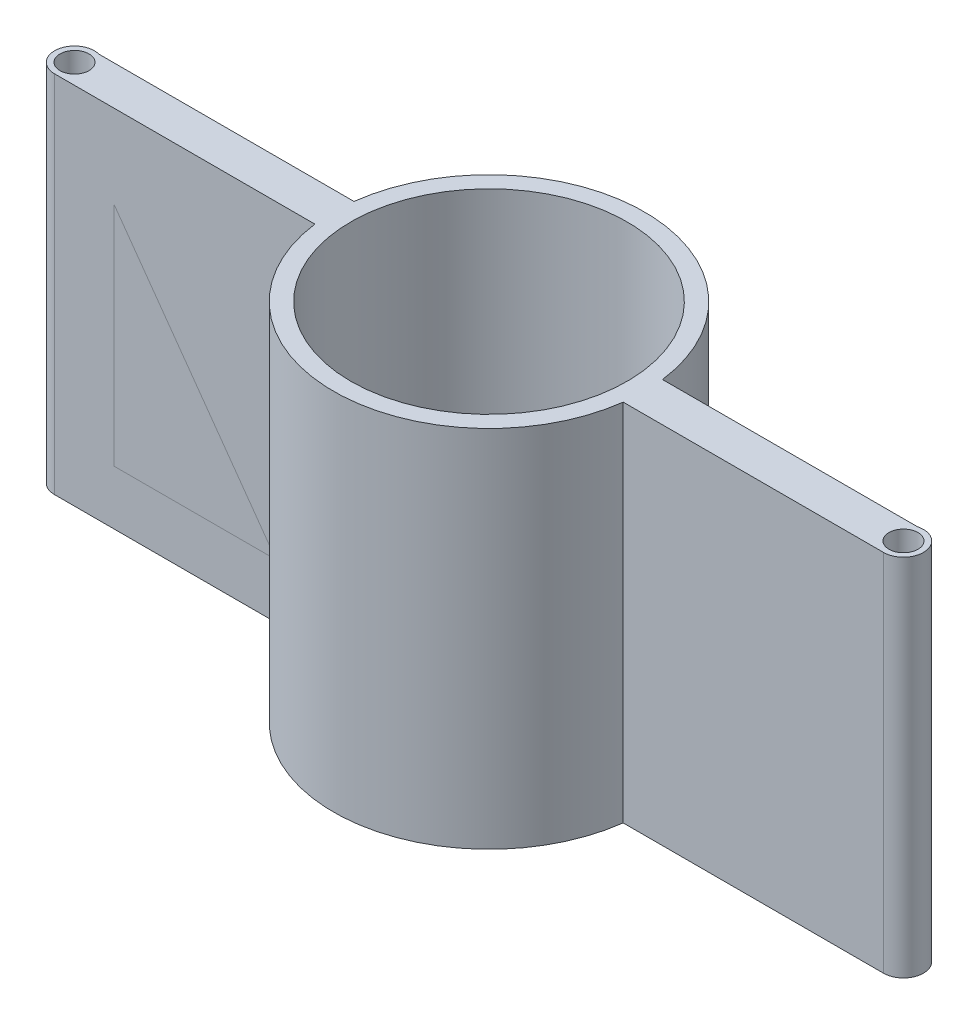
ISO-10303-21;
HEADER;
FILE_DESCRIPTION(('STEP AP214'),'2;1');
FILE_NAME('part.step','',(''),(''),'','','');
FILE_SCHEMA(('AUTOMOTIVE_DESIGN { 1 0 10303 214 1 1 1 1 }'));
ENDSEC;
DATA;
#1=APPLICATION_CONTEXT('core data for automotive mechanical design processes');
#2=APPLICATION_PROTOCOL_DEFINITION('international standard','automotive_design',2000,#1);
#3=PRODUCT_CONTEXT('',#1,'mechanical');
#4=PRODUCT('Part','Part','',(#3));
#5=PRODUCT_RELATED_PRODUCT_CATEGORY('part','',(#4));
#6=PRODUCT_DEFINITION_FORMATION('','',#4);
#7=PRODUCT_DEFINITION_CONTEXT('part definition',#1,'design');
#8=PRODUCT_DEFINITION('design','',#6,#7);
#9=PRODUCT_DEFINITION_SHAPE('','',#8);
#10=(LENGTH_UNIT() NAMED_UNIT(*) SI_UNIT(.MILLI.,.METRE.));
#11=(NAMED_UNIT(*) PLANE_ANGLE_UNIT() SI_UNIT($,.RADIAN.));
#12=(NAMED_UNIT(*) SI_UNIT($,.STERADIAN.) SOLID_ANGLE_UNIT());
#13=UNCERTAINTY_MEASURE_WITH_UNIT(LENGTH_MEASURE(1.E-05),#10,'distance_accuracy_value','');
#14=(GEOMETRIC_REPRESENTATION_CONTEXT(3) GLOBAL_UNCERTAINTY_ASSIGNED_CONTEXT((#13)) GLOBAL_UNIT_ASSIGNED_CONTEXT((#10,
#11,#12)) REPRESENTATION_CONTEXT('',''));
#15=CARTESIAN_POINT('',(0.,0.,0.));
#16=DIRECTION('',(0.,0.,1.));
#17=DIRECTION('',(1.,0.,0.));
#18=AXIS2_PLACEMENT_3D('',#15,#16,#17);
#19=CARTESIAN_POINT('',(0.,67.,3.66914743507707));
#20=DIRECTION('',(0.,0.,1.));
#21=DIRECTION('',(1.,0.,0.));
#22=AXIS2_PLACEMENT_3D('',#19,#20,#21);
#23=PLANE('',#22);
#24=DIRECTION('',(0.,1.,0.));
#25=VECTOR('',#24,1.);
#26=CARTESIAN_POINT('',(28.3548949710382,57.,3.66914743507707));
#27=LINE('',#26,#25);
#28=CARTESIAN_POINT('',(28.3548949710382,10.,3.66914743507707));
#29=VERTEX_POINT('',#28);
#30=CARTESIAN_POINT('',(28.3548949710382,57.,3.66914743507707));
#31=VERTEX_POINT('',#30);
#32=EDGE_CURVE('E62',#29,#31,#27,.T.);
#33=ORIENTED_EDGE('',*,*,#32,.F.);
#34=DIRECTION('',(-1.,0.,0.));
#35=VECTOR('',#34,1.);
#36=CARTESIAN_POINT('',(28.3548949710382,10.,3.66914743507707));
#37=LINE('',#36,#35);
#38=CARTESIAN_POINT('',(65.2345536167447,9.99999999999999,3.66914743507707));
#39=VERTEX_POINT('',#38);
#40=EDGE_CURVE('E85',#39,#29,#37,.T.);
#41=ORIENTED_EDGE('',*,*,#40,.F.);
#42=DIRECTION('',(0.,-1.,0.));
#43=VECTOR('',#42,1.);
#44=CARTESIAN_POINT('',(65.2345536167447,57.,3.66914743507707));
#45=LINE('',#44,#43);
#46=CARTESIAN_POINT('',(65.2345536167447,57.,3.66914743507707));
#47=VERTEX_POINT('',#46);
#48=EDGE_CURVE('E90',#47,#39,#45,.T.);
#49=ORIENTED_EDGE('',*,*,#48,.F.);
#50=DIRECTION('',(1.,0.,0.));
#51=VECTOR('',#50,1.);
#52=CARTESIAN_POINT('',(28.3548949710382,57.,3.66914743507707));
#53=LINE('',#52,#51);
#54=EDGE_CURVE('E105',#31,#47,#53,.T.);
#55=ORIENTED_EDGE('',*,*,#54,.F.);
#56=EDGE_LOOP('',(#33,#41,#49,#55));
#57=FACE_BOUND('',#56,.T.);
#58=ADVANCED_FACE('F54',(#57),#23,.T.);
#59=CARTESIAN_POINT('',(0.,0.,-3.53985256492292));
#60=DIRECTION('',(0.,0.,1.));
#61=DIRECTION('',(1.,0.,0.));
#62=AXIS2_PLACEMENT_3D('',#59,#60,#61);
#63=PLANE('',#62);
#64=DIRECTION('',(0.,1.,0.));
#65=VECTOR('',#64,1.);
#66=CARTESIAN_POINT('',(28.3548949710382,57.,-3.53985256492291));
#67=LINE('',#66,#65);
#68=CARTESIAN_POINT('',(28.3548949710382,10.,-3.53985256492291));
#69=VERTEX_POINT('',#68);
#70=CARTESIAN_POINT('',(28.3548949710382,57.,-3.53985256492291));
#71=VERTEX_POINT('',#70);
#72=EDGE_CURVE('E114',#69,#71,#67,.T.);
#73=ORIENTED_EDGE('',*,*,#72,.T.);
#74=DIRECTION('',(1.,0.,0.));
#75=VECTOR('',#74,1.);
#76=CARTESIAN_POINT('',(28.3548949710382,57.,-3.53985256492291));
#77=LINE('',#76,#75);
#78=CARTESIAN_POINT('',(65.2345536167447,57.,-3.53985256492291));
#79=VERTEX_POINT('',#78);
#80=EDGE_CURVE('E103',#71,#79,#77,.T.);
#81=ORIENTED_EDGE('',*,*,#80,.T.);
#82=DIRECTION('',(0.,-1.,0.));
#83=VECTOR('',#82,1.);
#84=CARTESIAN_POINT('',(65.2345536167447,57.,-3.53985256492291));
#85=LINE('',#84,#83);
#86=CARTESIAN_POINT('',(65.2345536167447,9.99999999999999,-3.53985256492291));
#87=VERTEX_POINT('',#86);
#88=EDGE_CURVE('E106',#79,#87,#85,.T.);
#89=ORIENTED_EDGE('',*,*,#88,.T.);
#90=DIRECTION('',(-1.,0.,0.));
#91=VECTOR('',#90,1.);
#92=CARTESIAN_POINT('',(28.3548949710382,10.,-3.53985256492291));
#93=LINE('',#92,#91);
#94=EDGE_CURVE('E111',#87,#69,#93,.T.);
#95=ORIENTED_EDGE('',*,*,#94,.T.);
#96=EDGE_LOOP('',(#73,#81,#89,#95));
#97=FACE_BOUND('',#96,.T.);
#98=ADVANCED_FACE('F113',(#97),#63,.F.);
#99=CARTESIAN_POINT('',(28.3548949710382,57.,63.4111696792548));
#100=DIRECTION('',(0.,1.,0.));
#101=DIRECTION('',(-1.,0.,0.));
#102=AXIS2_PLACEMENT_3D('',#99,#100,#101);
#103=PLANE('',#102);
#104=DIRECTION('',(0.,0.,-1.));
#105=VECTOR('',#104,1.);
#106=CARTESIAN_POINT('',(28.3548949710382,57.,63.4111696792548));
#107=LINE('',#106,#105);
#108=EDGE_CURVE('E12',#31,#71,#107,.T.);
#109=ORIENTED_EDGE('',*,*,#108,.F.);
#110=ORIENTED_EDGE('',*,*,#54,.T.);
#111=DIRECTION('',(0.,0.,-1.));
#112=VECTOR('',#111,1.);
#113=CARTESIAN_POINT('',(65.2345536167447,57.,63.4111696792548));
#114=LINE('',#113,#112);
#115=EDGE_CURVE('E100',#47,#79,#114,.T.);
#116=ORIENTED_EDGE('',*,*,#115,.T.);
#117=ORIENTED_EDGE('',*,*,#80,.F.);
#118=EDGE_LOOP('',(#109,#110,#116,#117));
#119=FACE_BOUND('',#118,.T.);
#120=ADVANCED_FACE('F101',(#119),#103,.T.);
#121=CARTESIAN_POINT('',(65.2345536167447,57.,63.4111696792548));
#122=DIRECTION('',(1.,0.,0.));
#123=DIRECTION('',(0.,1.,0.));
#124=AXIS2_PLACEMENT_3D('',#121,#122,#123);
#125=PLANE('',#124);
#126=ORIENTED_EDGE('',*,*,#115,.F.);
#127=ORIENTED_EDGE('',*,*,#48,.T.);
#128=DIRECTION('',(0.,0.,-1.));
#129=VECTOR('',#128,1.);
#130=CARTESIAN_POINT('',(65.2345536167446,9.99999999999999,63.4111696792548));
#131=LINE('',#130,#129);
#132=EDGE_CURVE('E95',#39,#87,#131,.T.);
#133=ORIENTED_EDGE('',*,*,#132,.T.);
#134=ORIENTED_EDGE('',*,*,#88,.F.);
#135=EDGE_LOOP('',(#126,#127,#133,#134));
#136=FACE_BOUND('',#135,.T.);
#137=ADVANCED_FACE('F107',(#136),#125,.T.);
#138=CARTESIAN_POINT('',(28.3548949710382,10.,63.4111696792548));
#139=DIRECTION('',(0.,-1.,0.));
#140=DIRECTION('',(1.,0.,0.));
#141=AXIS2_PLACEMENT_3D('',#138,#139,#140);
#142=PLANE('',#141);
#143=ORIENTED_EDGE('',*,*,#132,.F.);
#144=ORIENTED_EDGE('',*,*,#40,.T.);
#145=DIRECTION('',(0.,0.,-1.));
#146=VECTOR('',#145,1.);
#147=CARTESIAN_POINT('',(28.3548949710382,10.,63.4111696792548));
#148=LINE('',#147,#146);
#149=EDGE_CURVE('E121',#29,#69,#148,.T.);
#150=ORIENTED_EDGE('',*,*,#149,.T.);
#151=ORIENTED_EDGE('',*,*,#94,.F.);
#152=EDGE_LOOP('',(#143,#144,#150,#151));
#153=FACE_BOUND('',#152,.T.);
#154=ADVANCED_FACE('F127',(#153),#142,.T.);
#155=CARTESIAN_POINT('',(28.3548949710382,57.,63.4111696792548));
#156=DIRECTION('',(-1.,0.,0.));
#157=DIRECTION('',(0.,-1.,0.));
#158=AXIS2_PLACEMENT_3D('',#155,#156,#157);
#159=PLANE('',#158);
#160=ORIENTED_EDGE('',*,*,#149,.F.);
#161=ORIENTED_EDGE('',*,*,#32,.T.);
#162=ORIENTED_EDGE('',*,*,#108,.T.);
#163=ORIENTED_EDGE('',*,*,#72,.F.);
#164=EDGE_LOOP('',(#160,#161,#162,#163));
#165=FACE_BOUND('',#164,.T.);
#166=ADVANCED_FACE('F128',(#165),#159,.T.);
#167=CLOSED_SHELL('',(#58,#98,#120,#137,#154,#166));
#168=MANIFOLD_SOLID_BREP('B2',#167);
#169=CARTESIAN_POINT('',(-28.3548949710382,57.,63.4111696792548));
#170=DIRECTION('',(1.,0.,0.));
#171=DIRECTION('',(0.,1.,0.));
#172=AXIS2_PLACEMENT_3D('',#169,#170,#171);
#173=PLANE('',#172);
#174=DIRECTION('',(0.,1.,0.));
#175=VECTOR('',#174,1.);
#176=CARTESIAN_POINT('',(-28.3548949710382,57.,3.66914743507706));
#177=LINE('',#176,#175);
#178=CARTESIAN_POINT('',(-28.3548949710382,10.,3.66914743507706));
#179=VERTEX_POINT('',#178);
#180=CARTESIAN_POINT('',(-28.3548949710382,57.,3.66914743507706));
#181=VERTEX_POINT('',#180);
#182=EDGE_CURVE('E195',#179,#181,#177,.T.);
#183=ORIENTED_EDGE('',*,*,#182,.F.);
#184=DIRECTION('',(0.,0.,-1.));
#185=VECTOR('',#184,1.);
#186=CARTESIAN_POINT('',(-28.3548949710382,10.,63.4111696792548));
#187=LINE('',#186,#185);
#188=CARTESIAN_POINT('',(-28.3548949710382,10.,-3.53985256492294));
#189=VERTEX_POINT('',#188);
#190=EDGE_CURVE('E223',#179,#189,#187,.T.);
#191=ORIENTED_EDGE('',*,*,#190,.T.);
#192=DIRECTION('',(0.,-1.,0.));
#193=VECTOR('',#192,1.);
#194=CARTESIAN_POINT('',(-28.3548949710382,57.,-3.53985256492294));
#195=LINE('',#194,#193);
#196=CARTESIAN_POINT('',(-28.3548949710382,57.,-3.53985256492294));
#197=VERTEX_POINT('',#196);
#198=EDGE_CURVE('E227',#197,#189,#195,.T.);
#199=ORIENTED_EDGE('',*,*,#198,.F.);
#200=DIRECTION('',(0.,0.,-1.));
#201=VECTOR('',#200,1.);
#202=CARTESIAN_POINT('',(-28.3548949710382,57.,63.4111696792548));
#203=LINE('',#202,#201);
#204=EDGE_CURVE('E250',#181,#197,#203,.T.);
#205=ORIENTED_EDGE('',*,*,#204,.F.);
#206=EDGE_LOOP('',(#183,#191,#199,#205));
#207=FACE_BOUND('',#206,.T.);
#208=ADVANCED_FACE('F187',(#207),#173,.T.);
#209=CARTESIAN_POINT('',(-28.3548949710382,57.,63.4111696792548));
#210=DIRECTION('',(0.,1.,0.));
#211=DIRECTION('',(0.,0.,1.));
#212=AXIS2_PLACEMENT_3D('',#209,#210,#211);
#213=PLANE('',#212);
#214=DIRECTION('',(-1.,0.,0.));
#215=VECTOR('',#214,1.);
#216=CARTESIAN_POINT('',(-28.3548949710382,57.,3.66914743507706));
#217=LINE('',#216,#215);
#218=CARTESIAN_POINT('',(-65.2345536167447,57.,3.66914743507706));
#219=VERTEX_POINT('',#218);
#220=EDGE_CURVE('E201',#181,#219,#217,.T.);
#221=ORIENTED_EDGE('',*,*,#220,.F.);
#222=ORIENTED_EDGE('',*,*,#204,.T.);
#223=DIRECTION('',(1.,0.,0.));
#224=VECTOR('',#223,1.);
#225=CARTESIAN_POINT('',(-28.3548949710382,57.,-3.53985256492294));
#226=LINE('',#225,#224);
#227=CARTESIAN_POINT('',(-65.2345536167447,57.,-3.53985256492294));
#228=VERTEX_POINT('',#227);
#229=EDGE_CURVE('E232',#228,#197,#226,.T.);
#230=ORIENTED_EDGE('',*,*,#229,.F.);
#231=DIRECTION('',(0.,0.,-1.));
#232=VECTOR('',#231,1.);
#233=CARTESIAN_POINT('',(-65.2345536167447,57.,63.4111696792548));
#234=LINE('',#233,#232);
#235=EDGE_CURVE('E253',#219,#228,#234,.T.);
#236=ORIENTED_EDGE('',*,*,#235,.F.);
#237=EDGE_LOOP('',(#221,#222,#230,#236));
#238=FACE_BOUND('',#237,.T.);
#239=ADVANCED_FACE('F259',(#238),#213,.T.);
#240=CARTESIAN_POINT('',(-65.2345536167447,57.,63.4111696792548));
#241=DIRECTION('',(-1.,0.,0.));
#242=DIRECTION('',(0.,-1.,0.));
#243=AXIS2_PLACEMENT_3D('',#240,#241,#242);
#244=PLANE('',#243);
#245=DIRECTION('',(0.,-1.,0.));
#246=VECTOR('',#245,1.);
#247=CARTESIAN_POINT('',(-65.2345536167447,57.,3.66914743507706));
#248=LINE('',#247,#246);
#249=CARTESIAN_POINT('',(-65.2345536167447,10.,3.66914743507706));
#250=VERTEX_POINT('',#249);
#251=EDGE_CURVE('E252',#219,#250,#248,.T.);
#252=ORIENTED_EDGE('',*,*,#251,.F.);
#253=ORIENTED_EDGE('',*,*,#235,.T.);
#254=DIRECTION('',(0.,1.,0.));
#255=VECTOR('',#254,1.);
#256=CARTESIAN_POINT('',(-65.2345536167447,57.,-3.53985256492294));
#257=LINE('',#256,#255);
#258=CARTESIAN_POINT('',(-65.2345536167447,10.,-3.53985256492294));
#259=VERTEX_POINT('',#258);
#260=EDGE_CURVE('E240',#259,#228,#257,.T.);
#261=ORIENTED_EDGE('',*,*,#260,.F.);
#262=DIRECTION('',(0.,0.,-1.));
#263=VECTOR('',#262,1.);
#264=CARTESIAN_POINT('',(-65.2345536167447,10.,63.4111696792548));
#265=LINE('',#264,#263);
#266=EDGE_CURVE('E231',#250,#259,#265,.T.);
#267=ORIENTED_EDGE('',*,*,#266,.F.);
#268=EDGE_LOOP('',(#252,#253,#261,#267));
#269=FACE_BOUND('',#268,.T.);
#270=ADVANCED_FACE('F257',(#269),#244,.T.);
#271=CARTESIAN_POINT('',(-28.3548949710382,10.,63.4111696792548));
#272=DIRECTION('',(0.,-1.,0.));
#273=DIRECTION('',(1.,0.,0.));
#274=AXIS2_PLACEMENT_3D('',#271,#272,#273);
#275=PLANE('',#274);
#276=DIRECTION('',(1.,0.,0.));
#277=VECTOR('',#276,1.);
#278=CARTESIAN_POINT('',(-28.3548949710382,10.,3.66914743507706));
#279=LINE('',#278,#277);
#280=EDGE_CURVE('E52',#250,#179,#279,.T.);
#281=ORIENTED_EDGE('',*,*,#280,.F.);
#282=ORIENTED_EDGE('',*,*,#266,.T.);
#283=DIRECTION('',(-1.,0.,0.));
#284=VECTOR('',#283,1.);
#285=CARTESIAN_POINT('',(-28.3548949710382,10.,-3.53985256492294));
#286=LINE('',#285,#284);
#287=EDGE_CURVE('E234',#189,#259,#286,.T.);
#288=ORIENTED_EDGE('',*,*,#287,.F.);
#289=ORIENTED_EDGE('',*,*,#190,.F.);
#290=EDGE_LOOP('',(#281,#282,#288,#289));
#291=FACE_BOUND('',#290,.T.);
#292=ADVANCED_FACE('F235',(#291),#275,.T.);
#293=CARTESIAN_POINT('',(0.,0.,-3.53985256492294));
#294=DIRECTION('',(0.,0.,-1.));
#295=DIRECTION('',(-1.,0.,0.));
#296=AXIS2_PLACEMENT_3D('',#293,#294,#295);
#297=PLANE('',#296);
#298=ORIENTED_EDGE('',*,*,#198,.T.);
#299=ORIENTED_EDGE('',*,*,#287,.T.);
#300=ORIENTED_EDGE('',*,*,#260,.T.);
#301=ORIENTED_EDGE('',*,*,#229,.T.);
#302=EDGE_LOOP('',(#298,#299,#300,#301));
#303=FACE_BOUND('',#302,.T.);
#304=ADVANCED_FACE('F242',(#303),#297,.T.);
#305=CARTESIAN_POINT('',(0.,67.,3.66914743507705));
#306=DIRECTION('',(0.,0.,-1.));
#307=DIRECTION('',(-1.,0.,0.));
#308=AXIS2_PLACEMENT_3D('',#305,#306,#307);
#309=PLANE('',#308);
#310=ORIENTED_EDGE('',*,*,#182,.T.);
#311=ORIENTED_EDGE('',*,*,#220,.T.);
#312=ORIENTED_EDGE('',*,*,#251,.T.);
#313=ORIENTED_EDGE('',*,*,#280,.T.);
#314=EDGE_LOOP('',(#310,#311,#312,#313));
#315=FACE_BOUND('',#314,.T.);
#316=ADVANCED_FACE('F261',(#315),#309,.F.);
#317=CLOSED_SHELL('',(#208,#239,#270,#292,#304,#316));
#318=MANIFOLD_SOLID_BREP('B6',#317);
#319=CARTESIAN_POINT('',(0.,67.,-3.53985256492292));
#320=DIRECTION('',(0.,0.,-1.));
#321=DIRECTION('',(-1.,0.,0.));
#322=AXIS2_PLACEMENT_3D('',#319,#320,#321);
#323=PLANE('',#322);
#324=DIRECTION('',(1.,0.,0.));
#325=VECTOR('',#324,1.);
#326=CARTESIAN_POINT('',(0.,0.,-3.53985256492292));
#327=LINE('',#326,#325);
#328=CARTESIAN_POINT('',(28.3548949710382,0.,-3.53985256492291));
#329=VERTEX_POINT('',#328);
#330=CARTESIAN_POINT('',(75.2345536167447,0.,-3.53985256492291));
#331=VERTEX_POINT('',#330);
#332=EDGE_CURVE('E415',#329,#331,#327,.T.);
#333=ORIENTED_EDGE('',*,*,#332,.F.);
#334=DIRECTION('',(0.,-1.,0.));
#335=VECTOR('',#334,1.);
#336=CARTESIAN_POINT('',(28.3548949710382,67.,-3.53985256492291));
#337=LINE('',#336,#335);
#338=CARTESIAN_POINT('',(28.3548949710382,67.,-3.53985256492291));
#339=VERTEX_POINT('',#338);
#340=EDGE_CURVE('E185',#339,#329,#337,.T.);
#341=ORIENTED_EDGE('',*,*,#340,.F.);
#342=DIRECTION('',(1.,0.,0.));
#343=VECTOR('',#342,1.);
#344=CARTESIAN_POINT('',(0.,67.,-3.53985256492292));
#345=LINE('',#344,#343);
#346=CARTESIAN_POINT('',(75.2345536167447,67.,-3.53985256492291));
#347=VERTEX_POINT('',#346);
#348=EDGE_CURVE('E440',#339,#347,#345,.T.);
#349=ORIENTED_EDGE('',*,*,#348,.T.);
#350=DIRECTION('',(0.,-1.,0.));
#351=VECTOR('',#350,1.);
#352=CARTESIAN_POINT('',(75.2345536167447,67.,-3.53985256492291));
#353=LINE('',#352,#351);
#354=EDGE_CURVE('E327',#347,#331,#353,.T.);
#355=ORIENTED_EDGE('',*,*,#354,.T.);
#356=EDGE_LOOP('',(#333,#341,#349,#355));
#357=FACE_BOUND('',#356,.T.);
#358=ADVANCED_FACE('F311',(#357),#323,.T.);
#359=CARTESIAN_POINT('',(0.,67.,0.));
#360=DIRECTION('',(0.,-1.,0.));
#361=DIRECTION('',(0.,0.,-1.));
#362=AXIS2_PLACEMENT_3D('',#359,#360,#361);
#363=CYLINDRICAL_SURFACE('',#362,28.575);
#364=CARTESIAN_POINT('',(0.,0.,0.));
#365=DIRECTION('',(0.,1.,0.));
#366=DIRECTION('',(0.,0.,1.));
#367=AXIS2_PLACEMENT_3D('',#364,#365,#366);
#368=CIRCLE('',#367,28.575);
#369=CARTESIAN_POINT('',(-28.3548949710382,0.,-3.53985256492294));
#370=VERTEX_POINT('',#369);
#371=EDGE_CURVE('E417',#329,#370,#368,.T.);
#372=ORIENTED_EDGE('',*,*,#371,.T.);
#373=DIRECTION('',(0.,-1.,0.));
#374=VECTOR('',#373,1.);
#375=CARTESIAN_POINT('',(-28.3548949710382,67.,-3.53985256492294));
#376=LINE('',#375,#374);
#377=CARTESIAN_POINT('',(-28.3548949710382,67.,-3.53985256492294));
#378=VERTEX_POINT('',#377);
#379=EDGE_CURVE('E319',#378,#370,#376,.T.);
#380=ORIENTED_EDGE('',*,*,#379,.F.);
#381=CARTESIAN_POINT('',(0.,67.,0.));
#382=DIRECTION('',(0.,1.,0.));
#383=DIRECTION('',(0.,0.,1.));
#384=AXIS2_PLACEMENT_3D('',#381,#382,#383);
#385=CIRCLE('',#384,28.575);
#386=EDGE_CURVE('E474',#339,#378,#385,.T.);
#387=ORIENTED_EDGE('',*,*,#386,.F.);
#388=ORIENTED_EDGE('',*,*,#340,.T.);
#389=EDGE_LOOP('',(#372,#380,#387,#388));
#390=FACE_BOUND('',#389,.T.);
#391=ADVANCED_FACE('F492',(#390),#363,.T.);
#392=CARTESIAN_POINT('',(0.,67.,-3.53985256492294));
#393=DIRECTION('',(0.,0.,1.));
#394=DIRECTION('',(1.,0.,0.));
#395=AXIS2_PLACEMENT_3D('',#392,#393,#394);
#396=PLANE('',#395);
#397=DIRECTION('',(-1.,0.,0.));
#398=VECTOR('',#397,1.);
#399=CARTESIAN_POINT('',(0.,0.,-3.53985256492294));
#400=LINE('',#399,#398);
#401=CARTESIAN_POINT('',(-75.2345536167447,0.,-3.53985256492294));
#402=VERTEX_POINT('',#401);
#403=EDGE_CURVE('E419',#370,#402,#400,.T.);
#404=ORIENTED_EDGE('',*,*,#403,.T.);
#405=DIRECTION('',(0.,-1.,0.));
#406=VECTOR('',#405,1.);
#407=CARTESIAN_POINT('',(-75.2345536167447,67.,-3.53985256492294));
#408=LINE('',#407,#406);
#409=CARTESIAN_POINT('',(-75.2345536167447,67.,-3.53985256492294));
#410=VERTEX_POINT('',#409);
#411=EDGE_CURVE('E447',#410,#402,#408,.T.);
#412=ORIENTED_EDGE('',*,*,#411,.F.);
#413=DIRECTION('',(-1.,0.,0.));
#414=VECTOR('',#413,1.);
#415=CARTESIAN_POINT('',(0.,67.,-3.53985256492294));
#416=LINE('',#415,#414);
#417=EDGE_CURVE('E456',#378,#410,#416,.T.);
#418=ORIENTED_EDGE('',*,*,#417,.F.);
#419=ORIENTED_EDGE('',*,*,#379,.T.);
#420=EDGE_LOOP('',(#404,#412,#418,#419));
#421=FACE_BOUND('',#420,.T.);
#422=ADVANCED_FACE('F454',(#421),#396,.F.);
#423=CARTESIAN_POINT('',(-76.2,67.,0.));
#424=DIRECTION('',(0.,-1.,0.));
#425=DIRECTION('',(0.,0.,-1.));
#426=AXIS2_PLACEMENT_3D('',#423,#424,#425);
#427=CYLINDRICAL_SURFACE('',#426,3.66914743507703);
#428=CARTESIAN_POINT('',(-76.2,0.,0.));
#429=DIRECTION('',(0.,1.,0.));
#430=DIRECTION('',(0.,0.,1.));
#431=AXIS2_PLACEMENT_3D('',#428,#429,#430);
#432=CIRCLE('',#431,3.66914743507703);
#433=CARTESIAN_POINT('',(-76.2,0.,3.66914743507705));
#434=VERTEX_POINT('',#433);
#435=EDGE_CURVE('E421',#402,#434,#432,.T.);
#436=ORIENTED_EDGE('',*,*,#435,.T.);
#437=DIRECTION('',(0.,-1.,0.));
#438=VECTOR('',#437,1.);
#439=CARTESIAN_POINT('',(-76.2,67.,3.66914743507705));
#440=LINE('',#439,#438);
#441=CARTESIAN_POINT('',(-76.2,67.,3.66914743507705));
#442=VERTEX_POINT('',#441);
#443=EDGE_CURVE('E444',#442,#434,#440,.T.);
#444=ORIENTED_EDGE('',*,*,#443,.F.);
#445=CARTESIAN_POINT('',(-76.2,67.,0.));
#446=DIRECTION('',(0.,1.,0.));
#447=DIRECTION('',(0.,0.,1.));
#448=AXIS2_PLACEMENT_3D('',#445,#446,#447);
#449=CIRCLE('',#448,3.66914743507703);
#450=EDGE_CURVE('E470',#410,#442,#449,.T.);
#451=ORIENTED_EDGE('',*,*,#450,.F.);
#452=ORIENTED_EDGE('',*,*,#411,.T.);
#453=EDGE_LOOP('',(#436,#444,#451,#452));
#454=FACE_BOUND('',#453,.T.);
#455=ADVANCED_FACE('F466',(#454),#427,.T.);
#456=CARTESIAN_POINT('',(0.,67.,3.66914743507705));
#457=DIRECTION('',(0.,0.,-1.));
#458=DIRECTION('',(-1.,0.,0.));
#459=AXIS2_PLACEMENT_3D('',#456,#457,#458);
#460=PLANE('',#459);
#461=DIRECTION('',(1.,0.,0.));
#462=VECTOR('',#461,1.);
#463=CARTESIAN_POINT('',(0.,0.,3.66914743507705));
#464=LINE('',#463,#462);
#465=CARTESIAN_POINT('',(-28.3384541233227,0.,3.66914743507705));
#466=VERTEX_POINT('',#465);
#467=EDGE_CURVE('E423',#434,#466,#464,.T.);
#468=ORIENTED_EDGE('',*,*,#467,.T.);
#469=DIRECTION('',(0.,-1.,0.));
#470=VECTOR('',#469,1.);
#471=CARTESIAN_POINT('',(-28.3384541233227,67.,3.66914743507705));
#472=LINE('',#471,#470);
#473=CARTESIAN_POINT('',(-28.3384541233227,67.,3.66914743507705));
#474=VERTEX_POINT('',#473);
#475=EDGE_CURVE('E398',#474,#466,#472,.T.);
#476=ORIENTED_EDGE('',*,*,#475,.F.);
#477=DIRECTION('',(1.,0.,0.));
#478=VECTOR('',#477,1.);
#479=CARTESIAN_POINT('',(0.,67.,3.66914743507705));
#480=LINE('',#479,#478);
#481=EDGE_CURVE('E386',#442,#474,#480,.T.);
#482=ORIENTED_EDGE('',*,*,#481,.F.);
#483=ORIENTED_EDGE('',*,*,#443,.T.);
#484=EDGE_LOOP('',(#468,#476,#482,#483));
#485=FACE_BOUND('',#484,.T.);
#486=ADVANCED_FACE('F469',(#485),#460,.F.);
#487=CARTESIAN_POINT('',(0.,67.,0.));
#488=DIRECTION('',(0.,-1.,0.));
#489=DIRECTION('',(0.,0.,-1.));
#490=AXIS2_PLACEMENT_3D('',#487,#488,#489);
#491=CYLINDRICAL_SURFACE('',#490,28.575);
#492=CARTESIAN_POINT('',(0.,0.,0.));
#493=DIRECTION('',(0.,1.,0.));
#494=DIRECTION('',(0.,0.,1.));
#495=AXIS2_PLACEMENT_3D('',#492,#493,#494);
#496=CIRCLE('',#495,28.575);
#497=CARTESIAN_POINT('',(28.3384541233227,0.,3.66914743507707));
#498=VERTEX_POINT('',#497);
#499=EDGE_CURVE('E395',#466,#498,#496,.T.);
#500=ORIENTED_EDGE('',*,*,#499,.T.);
#501=DIRECTION('',(0.,-1.,0.));
#502=VECTOR('',#501,1.);
#503=CARTESIAN_POINT('',(28.3384541233227,67.,3.66914743507707));
#504=LINE('',#503,#502);
#505=CARTESIAN_POINT('',(28.3384541233227,67.,3.66914743507707));
#506=VERTEX_POINT('',#505);
#507=EDGE_CURVE('E392',#506,#498,#504,.T.);
#508=ORIENTED_EDGE('',*,*,#507,.F.);
#509=CARTESIAN_POINT('',(0.,67.,0.));
#510=DIRECTION('',(0.,1.,0.));
#511=DIRECTION('',(0.,0.,1.));
#512=AXIS2_PLACEMENT_3D('',#509,#510,#511);
#513=CIRCLE('',#512,28.575);
#514=EDGE_CURVE('E377',#474,#506,#513,.T.);
#515=ORIENTED_EDGE('',*,*,#514,.F.);
#516=ORIENTED_EDGE('',*,*,#475,.T.);
#517=EDGE_LOOP('',(#500,#508,#515,#516));
#518=FACE_BOUND('',#517,.T.);
#519=ADVANCED_FACE('F393',(#518),#491,.T.);
#520=CARTESIAN_POINT('',(0.,67.,3.66914743507707));
#521=DIRECTION('',(0.,0.,1.));
#522=DIRECTION('',(1.,0.,0.));
#523=AXIS2_PLACEMENT_3D('',#520,#521,#522);
#524=PLANE('',#523);
#525=DIRECTION('',(-1.,0.,0.));
#526=VECTOR('',#525,1.);
#527=CARTESIAN_POINT('',(0.,0.,3.66914743507707));
#528=LINE('',#527,#526);
#529=CARTESIAN_POINT('',(76.2,0.,3.66914743507706));
#530=VERTEX_POINT('',#529);
#531=EDGE_CURVE('E426',#530,#498,#528,.T.);
#532=ORIENTED_EDGE('',*,*,#531,.F.);
#533=DIRECTION('',(0.,-1.,0.));
#534=VECTOR('',#533,1.);
#535=CARTESIAN_POINT('',(76.2,67.,3.66914743507706));
#536=LINE('',#535,#534);
#537=CARTESIAN_POINT('',(76.2,67.,3.66914743507706));
#538=VERTEX_POINT('',#537);
#539=EDGE_CURVE('E352',#538,#530,#536,.T.);
#540=ORIENTED_EDGE('',*,*,#539,.F.);
#541=DIRECTION('',(-1.,0.,0.));
#542=VECTOR('',#541,1.);
#543=CARTESIAN_POINT('',(0.,67.,3.66914743507707));
#544=LINE('',#543,#542);
#545=EDGE_CURVE('E384',#538,#506,#544,.T.);
#546=ORIENTED_EDGE('',*,*,#545,.T.);
#547=ORIENTED_EDGE('',*,*,#507,.T.);
#548=EDGE_LOOP('',(#532,#540,#546,#547));
#549=FACE_BOUND('',#548,.T.);
#550=ADVANCED_FACE('F400',(#549),#524,.T.);
#551=CARTESIAN_POINT('',(0.,67.,0.));
#552=DIRECTION('',(0.,-1.,0.));
#553=DIRECTION('',(0.,0.,-1.));
#554=AXIS2_PLACEMENT_3D('',#551,#552,#553);
#555=CYLINDRICAL_SURFACE('',#554,25.4);
#556=CARTESIAN_POINT('',(0.,67.,0.));
#557=DIRECTION('',(0.,1.,0.));
#558=DIRECTION('',(0.,0.,1.));
#559=AXIS2_PLACEMENT_3D('',#556,#557,#558);
#560=CIRCLE('',#559,25.4);
#561=CARTESIAN_POINT('',(0.,67.,25.4));
#562=VERTEX_POINT('',#561);
#563=EDGE_CURVE('E409',#562,#562,#560,.T.);
#564=ORIENTED_EDGE('',*,*,#563,.T.);
#565=EDGE_LOOP('',(#564));
#566=FACE_BOUND('',#565,.T.);
#567=CARTESIAN_POINT('',(0.,0.,0.));
#568=DIRECTION('',(0.,1.,0.));
#569=DIRECTION('',(0.,0.,1.));
#570=AXIS2_PLACEMENT_3D('',#567,#568,#569);
#571=CIRCLE('',#570,25.4);
#572=CARTESIAN_POINT('',(0.,0.,25.4));
#573=VERTEX_POINT('',#572);
#574=EDGE_CURVE('E434',#573,#573,#571,.T.);
#575=ORIENTED_EDGE('',*,*,#574,.F.);
#576=EDGE_LOOP('',(#575));
#577=FACE_BOUND('',#576,.T.);
#578=ADVANCED_FACE('F487',(#566,#577),#555,.F.);
#579=CARTESIAN_POINT('',(76.2,67.,0.));
#580=DIRECTION('',(0.,-1.,0.));
#581=DIRECTION('',(0.,0.,-1.));
#582=AXIS2_PLACEMENT_3D('',#579,#580,#581);
#583=CYLINDRICAL_SURFACE('',#582,2.66914743507704);
#584=CARTESIAN_POINT('',(76.2,67.,0.));
#585=DIRECTION('',(0.,1.,0.));
#586=DIRECTION('',(0.,0.,1.));
#587=AXIS2_PLACEMENT_3D('',#584,#585,#586);
#588=CIRCLE('',#587,2.66914743507704);
#589=CARTESIAN_POINT('',(76.2,67.,2.66914743507707));
#590=VERTEX_POINT('',#589);
#591=EDGE_CURVE('E403',#590,#590,#588,.F.);
#592=ORIENTED_EDGE('',*,*,#591,.F.);
#593=EDGE_LOOP('',(#592));
#594=FACE_BOUND('',#593,.T.);
#595=CARTESIAN_POINT('',(76.2,0.,0.));
#596=DIRECTION('',(0.,1.,0.));
#597=DIRECTION('',(0.,0.,1.));
#598=AXIS2_PLACEMENT_3D('',#595,#596,#597);
#599=CIRCLE('',#598,2.66914743507704);
#600=CARTESIAN_POINT('',(76.2,0.,2.66914743507707));
#601=VERTEX_POINT('',#600);
#602=EDGE_CURVE('E431',#601,#601,#599,.F.);
#603=ORIENTED_EDGE('',*,*,#602,.T.);
#604=EDGE_LOOP('',(#603));
#605=FACE_BOUND('',#604,.T.);
#606=ADVANCED_FACE('F479',(#594,#605),#583,.F.);
#607=CARTESIAN_POINT('',(76.2,67.,0.));
#608=DIRECTION('',(0.,-1.,0.));
#609=DIRECTION('',(0.,0.,-1.));
#610=AXIS2_PLACEMENT_3D('',#607,#608,#609);
#611=CYLINDRICAL_SURFACE('',#610,3.66914743507703);
#612=CARTESIAN_POINT('',(76.2,0.,0.));
#613=DIRECTION('',(0.,1.,0.));
#614=DIRECTION('',(0.,0.,1.));
#615=AXIS2_PLACEMENT_3D('',#612,#613,#614);
#616=CIRCLE('',#615,3.66914743507703);
#617=EDGE_CURVE('E428',#331,#530,#616,.F.);
#618=ORIENTED_EDGE('',*,*,#617,.F.);
#619=ORIENTED_EDGE('',*,*,#354,.F.);
#620=CARTESIAN_POINT('',(76.2,67.,0.));
#621=DIRECTION('',(0.,1.,0.));
#622=DIRECTION('',(0.,0.,1.));
#623=AXIS2_PLACEMENT_3D('',#620,#621,#622);
#624=CIRCLE('',#623,3.66914743507703);
#625=EDGE_CURVE('E401',#347,#538,#624,.F.);
#626=ORIENTED_EDGE('',*,*,#625,.T.);
#627=ORIENTED_EDGE('',*,*,#539,.T.);
#628=EDGE_LOOP('',(#618,#619,#626,#627));
#629=FACE_BOUND('',#628,.T.);
#630=ADVANCED_FACE('F476',(#629),#611,.T.);
#631=CARTESIAN_POINT('',(-76.2,67.,0.));
#632=DIRECTION('',(0.,-1.,0.));
#633=DIRECTION('',(0.,0.,-1.));
#634=AXIS2_PLACEMENT_3D('',#631,#632,#633);
#635=CYLINDRICAL_SURFACE('',#634,2.66914743507704);
#636=CARTESIAN_POINT('',(-76.2,67.,0.));
#637=DIRECTION('',(0.,1.,0.));
#638=DIRECTION('',(0.,0.,1.));
#639=AXIS2_PLACEMENT_3D('',#636,#637,#638);
#640=CIRCLE('',#639,2.66914743507704);
#641=CARTESIAN_POINT('',(-76.2,67.,2.66914743507705));
#642=VERTEX_POINT('',#641);
#643=EDGE_CURVE('E412',#642,#642,#640,.T.);
#644=ORIENTED_EDGE('',*,*,#643,.T.);
#645=EDGE_LOOP('',(#644));
#646=FACE_BOUND('',#645,.T.);
#647=CARTESIAN_POINT('',(-76.2,0.,0.));
#648=DIRECTION('',(0.,1.,0.));
#649=DIRECTION('',(0.,0.,1.));
#650=AXIS2_PLACEMENT_3D('',#647,#648,#649);
#651=CIRCLE('',#650,2.66914743507704);
#652=CARTESIAN_POINT('',(-76.2,0.,2.66914743507705));
#653=VERTEX_POINT('',#652);
#654=EDGE_CURVE('E437',#653,#653,#651,.T.);
#655=ORIENTED_EDGE('',*,*,#654,.F.);
#656=EDGE_LOOP('',(#655));
#657=FACE_BOUND('',#656,.T.);
#658=ADVANCED_FACE('F478',(#646,#657),#635,.F.);
#659=CARTESIAN_POINT('',(0.,67.,0.));
#660=DIRECTION('',(0.,1.,0.));
#661=DIRECTION('',(0.,0.,1.));
#662=AXIS2_PLACEMENT_3D('',#659,#660,#661);
#663=PLANE('',#662);
#664=ORIENTED_EDGE('',*,*,#348,.F.);
#665=ORIENTED_EDGE('',*,*,#386,.T.);
#666=ORIENTED_EDGE('',*,*,#417,.T.);
#667=ORIENTED_EDGE('',*,*,#450,.T.);
#668=ORIENTED_EDGE('',*,*,#481,.T.);
#669=ORIENTED_EDGE('',*,*,#514,.T.);
#670=ORIENTED_EDGE('',*,*,#545,.F.);
#671=ORIENTED_EDGE('',*,*,#625,.F.);
#672=EDGE_LOOP('',(#664,#665,#666,#667,#668,#669,#670,#671));
#673=FACE_BOUND('',#672,.T.);
#674=ORIENTED_EDGE('',*,*,#591,.T.);
#675=EDGE_LOOP('',(#674));
#676=FACE_BOUND('',#675,.T.);
#677=ORIENTED_EDGE('',*,*,#563,.F.);
#678=EDGE_LOOP('',(#677));
#679=FACE_BOUND('',#678,.T.);
#680=ORIENTED_EDGE('',*,*,#643,.F.);
#681=EDGE_LOOP('',(#680));
#682=FACE_BOUND('',#681,.T.);
#683=ADVANCED_FACE('F380',(#673,#676,#679,#682),#663,.T.);
#684=CARTESIAN_POINT('',(0.,0.,0.));
#685=DIRECTION('',(0.,1.,0.));
#686=DIRECTION('',(0.,0.,1.));
#687=AXIS2_PLACEMENT_3D('',#684,#685,#686);
#688=PLANE('',#687);
#689=ORIENTED_EDGE('',*,*,#332,.T.);
#690=ORIENTED_EDGE('',*,*,#617,.T.);
#691=ORIENTED_EDGE('',*,*,#531,.T.);
#692=ORIENTED_EDGE('',*,*,#499,.F.);
#693=ORIENTED_EDGE('',*,*,#467,.F.);
#694=ORIENTED_EDGE('',*,*,#435,.F.);
#695=ORIENTED_EDGE('',*,*,#403,.F.);
#696=ORIENTED_EDGE('',*,*,#371,.F.);
#697=EDGE_LOOP('',(#689,#690,#691,#692,#693,#694,#695,#696));
#698=FACE_BOUND('',#697,.T.);
#699=ORIENTED_EDGE('',*,*,#602,.F.);
#700=EDGE_LOOP('',(#699));
#701=FACE_BOUND('',#700,.T.);
#702=ORIENTED_EDGE('',*,*,#574,.T.);
#703=EDGE_LOOP('',(#702));
#704=FACE_BOUND('',#703,.T.);
#705=ORIENTED_EDGE('',*,*,#654,.T.);
#706=EDGE_LOOP('',(#705));
#707=FACE_BOUND('',#706,.T.);
#708=ADVANCED_FACE('F461',(#698,#701,#704,#707),#688,.F.);
#709=CLOSED_SHELL('',(#358,#391,#422,#455,#486,#519,#550,#578,#606,#630,#658,#683,#708));
#710=MANIFOLD_SOLID_BREP('B46',#709);
#711=ADVANCED_BREP_SHAPE_REPRESENTATION('',(#18,#168,#318,#710),#14);
#712=SHAPE_DEFINITION_REPRESENTATION(#9,#711);
ENDSEC;
END-ISO-10303-21;
